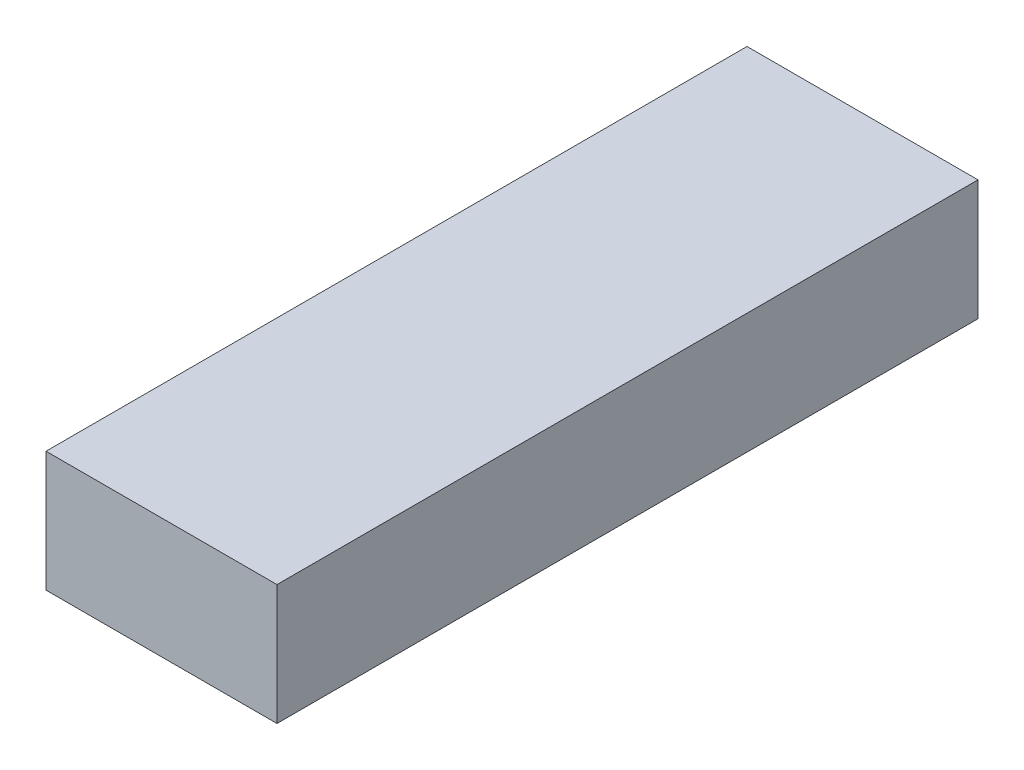
ISO-10303-21;
HEADER;
FILE_DESCRIPTION(('STEP AP214'),'2;1');
FILE_NAME('part.step','',(''),(''),'','','');
FILE_SCHEMA(('AUTOMOTIVE_DESIGN { 1 0 10303 214 1 1 1 1 }'));
ENDSEC;
DATA;
#1=APPLICATION_CONTEXT('core data for automotive mechanical design processes');
#2=APPLICATION_PROTOCOL_DEFINITION('international standard','automotive_design',2000,#1);
#3=PRODUCT_CONTEXT('',#1,'mechanical');
#4=PRODUCT('Part','Part','',(#3));
#5=PRODUCT_RELATED_PRODUCT_CATEGORY('part','',(#4));
#6=PRODUCT_DEFINITION_FORMATION('','',#4);
#7=PRODUCT_DEFINITION_CONTEXT('part definition',#1,'design');
#8=PRODUCT_DEFINITION('design','',#6,#7);
#9=PRODUCT_DEFINITION_SHAPE('','',#8);
#10=(LENGTH_UNIT() NAMED_UNIT(*) SI_UNIT(.MILLI.,.METRE.));
#11=(NAMED_UNIT(*) PLANE_ANGLE_UNIT() SI_UNIT($,.RADIAN.));
#12=(NAMED_UNIT(*) SI_UNIT($,.STERADIAN.) SOLID_ANGLE_UNIT());
#13=UNCERTAINTY_MEASURE_WITH_UNIT(LENGTH_MEASURE(1.E-05),#10,'distance_accuracy_value','');
#14=(GEOMETRIC_REPRESENTATION_CONTEXT(3) GLOBAL_UNCERTAINTY_ASSIGNED_CONTEXT((#13)) GLOBAL_UNIT_ASSIGNED_CONTEXT((#10,
#11,#12)) REPRESENTATION_CONTEXT('',''));
#15=CARTESIAN_POINT('',(0.,0.,0.));
#16=DIRECTION('',(0.,0.,1.));
#17=DIRECTION('',(1.,0.,0.));
#18=AXIS2_PLACEMENT_3D('',#15,#16,#17);
#19=CARTESIAN_POINT('',(-18.6370112956468,10.1345419847328,130.5));
#20=DIRECTION('',(1.,0.,0.));
#21=DIRECTION('',(0.,0.,-1.));
#22=AXIS2_PLACEMENT_3D('',#19,#20,#21);
#23=PLANE('',#22);
#24=DIRECTION('',(0.,-1.,0.));
#25=VECTOR('',#24,1.);
#26=CARTESIAN_POINT('',(-18.6370112956468,10.1345419847328,0.));
#27=LINE('',#26,#25);
#28=CARTESIAN_POINT('',(-18.6370112956468,10.1345419847328,0.));
#29=VERTEX_POINT('',#28);
#30=CARTESIAN_POINT('',(-18.6370112956468,-12.2654580152672,0.));
#31=VERTEX_POINT('',#30);
#32=EDGE_CURVE('E96',#29,#31,#27,.T.);
#33=ORIENTED_EDGE('',*,*,#32,.T.);
#34=DIRECTION('',(0.,0.,-1.));
#35=VECTOR('',#34,1.);
#36=CARTESIAN_POINT('',(-18.6370112956468,-12.2654580152672,130.5));
#37=LINE('',#36,#35);
#38=CARTESIAN_POINT('',(-18.6370112956468,-12.2654580152672,130.5));
#39=VERTEX_POINT('',#38);
#40=EDGE_CURVE('E11',#39,#31,#37,.T.);
#41=ORIENTED_EDGE('',*,*,#40,.F.);
#42=DIRECTION('',(0.,-1.,0.));
#43=VECTOR('',#42,1.);
#44=CARTESIAN_POINT('',(-18.6370112956468,10.1345419847328,130.5));
#45=LINE('',#44,#43);
#46=CARTESIAN_POINT('',(-18.6370112956468,10.1345419847328,130.5));
#47=VERTEX_POINT('',#46);
#48=EDGE_CURVE('E84',#47,#39,#45,.T.);
#49=ORIENTED_EDGE('',*,*,#48,.F.);
#50=DIRECTION('',(0.,0.,-1.));
#51=VECTOR('',#50,1.);
#52=CARTESIAN_POINT('',(-18.6370112956468,10.1345419847328,130.5));
#53=LINE('',#52,#51);
#54=EDGE_CURVE('E92',#47,#29,#53,.T.);
#55=ORIENTED_EDGE('',*,*,#54,.T.);
#56=EDGE_LOOP('',(#33,#41,#49,#55));
#57=FACE_BOUND('',#56,.T.);
#58=ADVANCED_FACE('F33',(#57),#23,.F.);
#59=CARTESIAN_POINT('',(-18.6370112956468,-12.2654580152672,130.5));
#60=DIRECTION('',(0.,1.,0.));
#61=DIRECTION('',(0.,0.,1.));
#62=AXIS2_PLACEMENT_3D('',#59,#60,#61);
#63=PLANE('',#62);
#64=DIRECTION('',(1.,0.,0.));
#65=VECTOR('',#64,1.);
#66=CARTESIAN_POINT('',(-18.6370112956468,-12.2654580152672,0.));
#67=LINE('',#66,#65);
#68=CARTESIAN_POINT('',(24.3629887043532,-12.2654580152672,0.));
#69=VERTEX_POINT('',#68);
#70=EDGE_CURVE('E88',#31,#69,#67,.T.);
#71=ORIENTED_EDGE('',*,*,#70,.T.);
#72=DIRECTION('',(0.,0.,-1.));
#73=VECTOR('',#72,1.);
#74=CARTESIAN_POINT('',(24.3629887043532,-12.2654580152672,130.5));
#75=LINE('',#74,#73);
#76=CARTESIAN_POINT('',(24.3629887043532,-12.2654580152672,130.5));
#77=VERTEX_POINT('',#76);
#78=EDGE_CURVE('E41',#77,#69,#75,.T.);
#79=ORIENTED_EDGE('',*,*,#78,.F.);
#80=DIRECTION('',(1.,0.,0.));
#81=VECTOR('',#80,1.);
#82=CARTESIAN_POINT('',(-18.6370112956468,-12.2654580152672,130.5));
#83=LINE('',#82,#81);
#84=EDGE_CURVE('E79',#39,#77,#83,.T.);
#85=ORIENTED_EDGE('',*,*,#84,.F.);
#86=ORIENTED_EDGE('',*,*,#40,.T.);
#87=EDGE_LOOP('',(#71,#79,#85,#86));
#88=FACE_BOUND('',#87,.T.);
#89=ADVANCED_FACE('F87',(#88),#63,.F.);
#90=CARTESIAN_POINT('',(24.3629887043532,10.1345419847328,130.5));
#91=DIRECTION('',(-1.,0.,0.));
#92=DIRECTION('',(0.,-1.,0.));
#93=AXIS2_PLACEMENT_3D('',#90,#91,#92);
#94=PLANE('',#93);
#95=DIRECTION('',(0.,1.,0.));
#96=VECTOR('',#95,1.);
#97=CARTESIAN_POINT('',(24.3629887043532,10.1345419847328,0.));
#98=LINE('',#97,#96);
#99=CARTESIAN_POINT('',(24.3629887043532,10.1345419847328,0.));
#100=VERTEX_POINT('',#99);
#101=EDGE_CURVE('E66',#69,#100,#98,.T.);
#102=ORIENTED_EDGE('',*,*,#101,.T.);
#103=DIRECTION('',(0.,0.,-1.));
#104=VECTOR('',#103,1.);
#105=CARTESIAN_POINT('',(24.3629887043532,10.1345419847328,130.5));
#106=LINE('',#105,#104);
#107=CARTESIAN_POINT('',(24.3629887043532,10.1345419847328,130.5));
#108=VERTEX_POINT('',#107);
#109=EDGE_CURVE('E89',#108,#100,#106,.T.);
#110=ORIENTED_EDGE('',*,*,#109,.F.);
#111=DIRECTION('',(0.,1.,0.));
#112=VECTOR('',#111,1.);
#113=CARTESIAN_POINT('',(24.3629887043532,10.1345419847328,130.5));
#114=LINE('',#113,#112);
#115=EDGE_CURVE('E82',#77,#108,#114,.T.);
#116=ORIENTED_EDGE('',*,*,#115,.F.);
#117=ORIENTED_EDGE('',*,*,#78,.T.);
#118=EDGE_LOOP('',(#102,#110,#116,#117));
#119=FACE_BOUND('',#118,.T.);
#120=ADVANCED_FACE('F90',(#119),#94,.F.);
#121=CARTESIAN_POINT('',(-18.6370112956468,10.1345419847328,130.5));
#122=DIRECTION('',(0.,-1.,0.));
#123=DIRECTION('',(0.,0.,-1.));
#124=AXIS2_PLACEMENT_3D('',#121,#122,#123);
#125=PLANE('',#124);
#126=DIRECTION('',(-1.,0.,0.));
#127=VECTOR('',#126,1.);
#128=CARTESIAN_POINT('',(-18.6370112956468,10.1345419847328,0.));
#129=LINE('',#128,#127);
#130=EDGE_CURVE('E72',#100,#29,#129,.T.);
#131=ORIENTED_EDGE('',*,*,#130,.T.);
#132=ORIENTED_EDGE('',*,*,#54,.F.);
#133=DIRECTION('',(-1.,0.,0.));
#134=VECTOR('',#133,1.);
#135=CARTESIAN_POINT('',(-18.6370112956468,10.1345419847328,130.5));
#136=LINE('',#135,#134);
#137=EDGE_CURVE('E49',#108,#47,#136,.T.);
#138=ORIENTED_EDGE('',*,*,#137,.F.);
#139=ORIENTED_EDGE('',*,*,#109,.T.);
#140=EDGE_LOOP('',(#131,#132,#138,#139));
#141=FACE_BOUND('',#140,.T.);
#142=ADVANCED_FACE('F103',(#141),#125,.F.);
#143=CARTESIAN_POINT('',(0.,0.,130.5));
#144=DIRECTION('',(0.,0.,1.));
#145=DIRECTION('',(1.,0.,0.));
#146=AXIS2_PLACEMENT_3D('',#143,#144,#145);
#147=PLANE('',#146);
#148=ORIENTED_EDGE('',*,*,#48,.T.);
#149=ORIENTED_EDGE('',*,*,#84,.T.);
#150=ORIENTED_EDGE('',*,*,#115,.T.);
#151=ORIENTED_EDGE('',*,*,#137,.T.);
#152=EDGE_LOOP('',(#148,#149,#150,#151));
#153=FACE_BOUND('',#152,.T.);
#154=ADVANCED_FACE('F80',(#153),#147,.T.);
#155=CARTESIAN_POINT('',(0.,0.,0.));
#156=DIRECTION('',(0.,0.,1.));
#157=DIRECTION('',(1.,0.,0.));
#158=AXIS2_PLACEMENT_3D('',#155,#156,#157);
#159=PLANE('',#158);
#160=ORIENTED_EDGE('',*,*,#32,.F.);
#161=ORIENTED_EDGE('',*,*,#130,.F.);
#162=ORIENTED_EDGE('',*,*,#101,.F.);
#163=ORIENTED_EDGE('',*,*,#70,.F.);
#164=EDGE_LOOP('',(#160,#161,#162,#163));
#165=FACE_BOUND('',#164,.T.);
#166=ADVANCED_FACE('F106',(#165),#159,.F.);
#167=CLOSED_SHELL('',(#58,#89,#120,#142,#154,#166));
#168=MANIFOLD_SOLID_BREP('B2',#167);
#169=ADVANCED_BREP_SHAPE_REPRESENTATION('',(#18,#168),#14);
#170=SHAPE_DEFINITION_REPRESENTATION(#9,#169);
ENDSEC;
END-ISO-10303-21;
